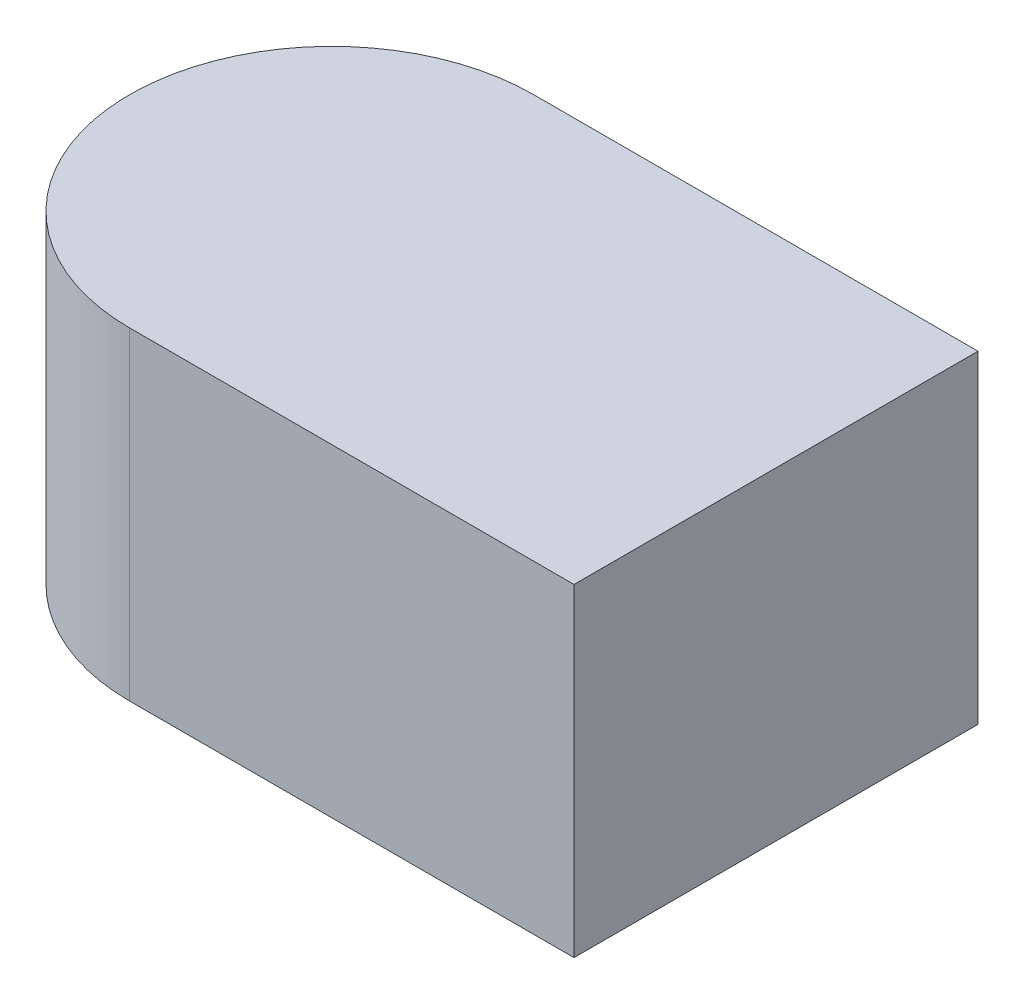
ISO-10303-21;
HEADER;
FILE_DESCRIPTION(('STEP AP214'),'2;1');
FILE_NAME('part.step','',(''),(''),'','','');
FILE_SCHEMA(('AUTOMOTIVE_DESIGN { 1 0 10303 214 1 1 1 1 }'));
ENDSEC;
DATA;
#1=APPLICATION_CONTEXT('core data for automotive mechanical design processes');
#2=APPLICATION_PROTOCOL_DEFINITION('international standard','automotive_design',2000,#1);
#3=PRODUCT_CONTEXT('',#1,'mechanical');
#4=PRODUCT('Part','Part','',(#3));
#5=PRODUCT_RELATED_PRODUCT_CATEGORY('part','',(#4));
#6=PRODUCT_DEFINITION_FORMATION('','',#4);
#7=PRODUCT_DEFINITION_CONTEXT('part definition',#1,'design');
#8=PRODUCT_DEFINITION('design','',#6,#7);
#9=PRODUCT_DEFINITION_SHAPE('','',#8);
#10=(LENGTH_UNIT() NAMED_UNIT(*) SI_UNIT(.MILLI.,.METRE.));
#11=(NAMED_UNIT(*) PLANE_ANGLE_UNIT() SI_UNIT($,.RADIAN.));
#12=(NAMED_UNIT(*) SI_UNIT($,.STERADIAN.) SOLID_ANGLE_UNIT());
#13=UNCERTAINTY_MEASURE_WITH_UNIT(LENGTH_MEASURE(1.E-05),#10,'distance_accuracy_value','');
#14=(GEOMETRIC_REPRESENTATION_CONTEXT(3) GLOBAL_UNCERTAINTY_ASSIGNED_CONTEXT((#13)) GLOBAL_UNIT_ASSIGNED_CONTEXT((#10,
#11,#12)) REPRESENTATION_CONTEXT('',''));
#15=CARTESIAN_POINT('',(0.,0.,0.));
#16=DIRECTION('',(0.,0.,1.));
#17=DIRECTION('',(1.,0.,0.));
#18=AXIS2_PLACEMENT_3D('',#15,#16,#17);
#19=CARTESIAN_POINT('',(0.,0.,0.));
#20=DIRECTION('',(0.,1.,0.));
#21=DIRECTION('',(1.,0.,0.));
#22=AXIS2_PLACEMENT_3D('',#19,#20,#21);
#23=PLANE('',#22);
#24=DIRECTION('',(0.,0.,-1.));
#25=VECTOR('',#24,1.);
#26=CARTESIAN_POINT('',(1.5,0.,-0.625));
#27=LINE('',#26,#25);
#28=CARTESIAN_POINT('',(1.5,0.,-0.625));
#29=VERTEX_POINT('',#28);
#30=CARTESIAN_POINT('',(1.5,0.,-0.875));
#31=VERTEX_POINT('',#30);
#32=EDGE_CURVE('E11',#29,#31,#27,.T.);
#33=ORIENTED_EDGE('',*,*,#32,.F.);
#34=DIRECTION('',(1.,0.,0.));
#35=VECTOR('',#34,1.);
#36=CARTESIAN_POINT('',(1.225,0.,-0.625));
#37=LINE('',#36,#35);
#38=CARTESIAN_POINT('',(1.225,0.,-0.625));
#39=VERTEX_POINT('',#38);
#40=EDGE_CURVE('E24',#39,#29,#37,.T.);
#41=ORIENTED_EDGE('',*,*,#40,.F.);
#42=CARTESIAN_POINT('',(1.225,0.,-0.75));
#43=DIRECTION('',(0.,1.,0.));
#44=DIRECTION('',(0.,0.,-1.));
#45=AXIS2_PLACEMENT_3D('',#42,#43,#44);
#46=CIRCLE('',#45,0.125);
#47=CARTESIAN_POINT('',(1.225,0.,-0.875));
#48=VERTEX_POINT('',#47);
#49=EDGE_CURVE('E61',#48,#39,#46,.T.);
#50=ORIENTED_EDGE('',*,*,#49,.F.);
#51=DIRECTION('',(-1.,0.,0.));
#52=VECTOR('',#51,1.);
#53=CARTESIAN_POINT('',(1.5,0.,-0.875));
#54=LINE('',#53,#52);
#55=EDGE_CURVE('E37',#31,#48,#54,.T.);
#56=ORIENTED_EDGE('',*,*,#55,.F.);
#57=EDGE_LOOP('',(#33,#41,#50,#56));
#58=FACE_BOUND('',#57,.T.);
#59=ADVANCED_FACE('F17',(#58),#23,.F.);
#60=CARTESIAN_POINT('',(1.5,0.,-0.875));
#61=DIRECTION('',(0.,0.,-1.));
#62=DIRECTION('',(-1.,0.,0.));
#63=AXIS2_PLACEMENT_3D('',#60,#61,#62);
#64=PLANE('',#63);
#65=DIRECTION('',(0.,1.,0.));
#66=VECTOR('',#65,1.);
#67=CARTESIAN_POINT('',(1.225,0.,-0.875));
#68=LINE('',#67,#66);
#69=CARTESIAN_POINT('',(1.225,0.2,-0.875));
#70=VERTEX_POINT('',#69);
#71=EDGE_CURVE('E84',#48,#70,#68,.T.);
#72=ORIENTED_EDGE('',*,*,#71,.T.);
#73=DIRECTION('',(-1.,0.,0.));
#74=VECTOR('',#73,1.);
#75=CARTESIAN_POINT('',(1.5,0.2,-0.875));
#76=LINE('',#75,#74);
#77=CARTESIAN_POINT('',(1.5,0.2,-0.875));
#78=VERTEX_POINT('',#77);
#79=EDGE_CURVE('E74',#78,#70,#76,.T.);
#80=ORIENTED_EDGE('',*,*,#79,.F.);
#81=DIRECTION('',(0.,1.,0.));
#82=VECTOR('',#81,1.);
#83=CARTESIAN_POINT('',(1.5,0.,-0.875));
#84=LINE('',#83,#82);
#85=EDGE_CURVE('E81',#31,#78,#84,.T.);
#86=ORIENTED_EDGE('',*,*,#85,.F.);
#87=ORIENTED_EDGE('',*,*,#55,.T.);
#88=EDGE_LOOP('',(#72,#80,#86,#87));
#89=FACE_BOUND('',#88,.T.);
#90=ADVANCED_FACE('F89',(#89),#64,.T.);
#91=CARTESIAN_POINT('',(1.5,0.,-0.625));
#92=DIRECTION('',(1.,0.,0.));
#93=DIRECTION('',(0.,0.,-1.));
#94=AXIS2_PLACEMENT_3D('',#91,#92,#93);
#95=PLANE('',#94);
#96=ORIENTED_EDGE('',*,*,#85,.T.);
#97=DIRECTION('',(0.,0.,-1.));
#98=VECTOR('',#97,1.);
#99=CARTESIAN_POINT('',(1.5,0.2,-0.625));
#100=LINE('',#99,#98);
#101=CARTESIAN_POINT('',(1.5,0.2,-0.625));
#102=VERTEX_POINT('',#101);
#103=EDGE_CURVE('E79',#102,#78,#100,.T.);
#104=ORIENTED_EDGE('',*,*,#103,.F.);
#105=DIRECTION('',(0.,1.,0.));
#106=VECTOR('',#105,1.);
#107=CARTESIAN_POINT('',(1.5,0.,-0.625));
#108=LINE('',#107,#106);
#109=EDGE_CURVE('E67',#29,#102,#108,.T.);
#110=ORIENTED_EDGE('',*,*,#109,.F.);
#111=ORIENTED_EDGE('',*,*,#32,.T.);
#112=EDGE_LOOP('',(#96,#104,#110,#111));
#113=FACE_BOUND('',#112,.T.);
#114=ADVANCED_FACE('F91',(#113),#95,.T.);
#115=CARTESIAN_POINT('',(1.225,0.,-0.625));
#116=DIRECTION('',(0.,0.,1.));
#117=DIRECTION('',(1.,0.,0.));
#118=AXIS2_PLACEMENT_3D('',#115,#116,#117);
#119=PLANE('',#118);
#120=ORIENTED_EDGE('',*,*,#109,.T.);
#121=DIRECTION('',(1.,0.,0.));
#122=VECTOR('',#121,1.);
#123=CARTESIAN_POINT('',(1.225,0.2,-0.625));
#124=LINE('',#123,#122);
#125=CARTESIAN_POINT('',(1.225,0.2,-0.625));
#126=VERTEX_POINT('',#125);
#127=EDGE_CURVE('E62',#126,#102,#124,.T.);
#128=ORIENTED_EDGE('',*,*,#127,.F.);
#129=DIRECTION('',(0.,1.,0.));
#130=VECTOR('',#129,1.);
#131=CARTESIAN_POINT('',(1.225,0.,-0.625));
#132=LINE('',#131,#130);
#133=EDGE_CURVE('E55',#39,#126,#132,.T.);
#134=ORIENTED_EDGE('',*,*,#133,.F.);
#135=ORIENTED_EDGE('',*,*,#40,.T.);
#136=EDGE_LOOP('',(#120,#128,#134,#135));
#137=FACE_BOUND('',#136,.T.);
#138=ADVANCED_FACE('F65',(#137),#119,.T.);
#139=CARTESIAN_POINT('',(1.225,0.,-0.75));
#140=DIRECTION('',(0.,1.,0.));
#141=DIRECTION('',(1.,0.,0.));
#142=AXIS2_PLACEMENT_3D('',#139,#140,#141);
#143=CYLINDRICAL_SURFACE('',#142,0.125);
#144=ORIENTED_EDGE('',*,*,#133,.T.);
#145=CARTESIAN_POINT('',(1.225,0.2,-0.75));
#146=DIRECTION('',(0.,1.,0.));
#147=DIRECTION('',(0.,0.,-1.));
#148=AXIS2_PLACEMENT_3D('',#145,#146,#147);
#149=CIRCLE('',#148,0.125);
#150=EDGE_CURVE('E60',#70,#126,#149,.T.);
#151=ORIENTED_EDGE('',*,*,#150,.F.);
#152=ORIENTED_EDGE('',*,*,#71,.F.);
#153=ORIENTED_EDGE('',*,*,#49,.T.);
#154=EDGE_LOOP('',(#144,#151,#152,#153));
#155=FACE_BOUND('',#154,.T.);
#156=ADVANCED_FACE('F57',(#155),#143,.T.);
#157=CARTESIAN_POINT('',(0.,0.2,0.));
#158=DIRECTION('',(0.,1.,0.));
#159=DIRECTION('',(1.,0.,0.));
#160=AXIS2_PLACEMENT_3D('',#157,#158,#159);
#161=PLANE('',#160);
#162=ORIENTED_EDGE('',*,*,#150,.T.);
#163=ORIENTED_EDGE('',*,*,#127,.T.);
#164=ORIENTED_EDGE('',*,*,#103,.T.);
#165=ORIENTED_EDGE('',*,*,#79,.T.);
#166=EDGE_LOOP('',(#162,#163,#164,#165));
#167=FACE_BOUND('',#166,.T.);
#168=ADVANCED_FACE('F72',(#167),#161,.T.);
#169=CLOSED_SHELL('',(#59,#90,#114,#138,#156,#168));
#170=MANIFOLD_SOLID_BREP('B1',#169);
#171=ADVANCED_BREP_SHAPE_REPRESENTATION('',(#18,#170),#14);
#172=SHAPE_DEFINITION_REPRESENTATION(#9,#171);
ENDSEC;
END-ISO-10303-21;
